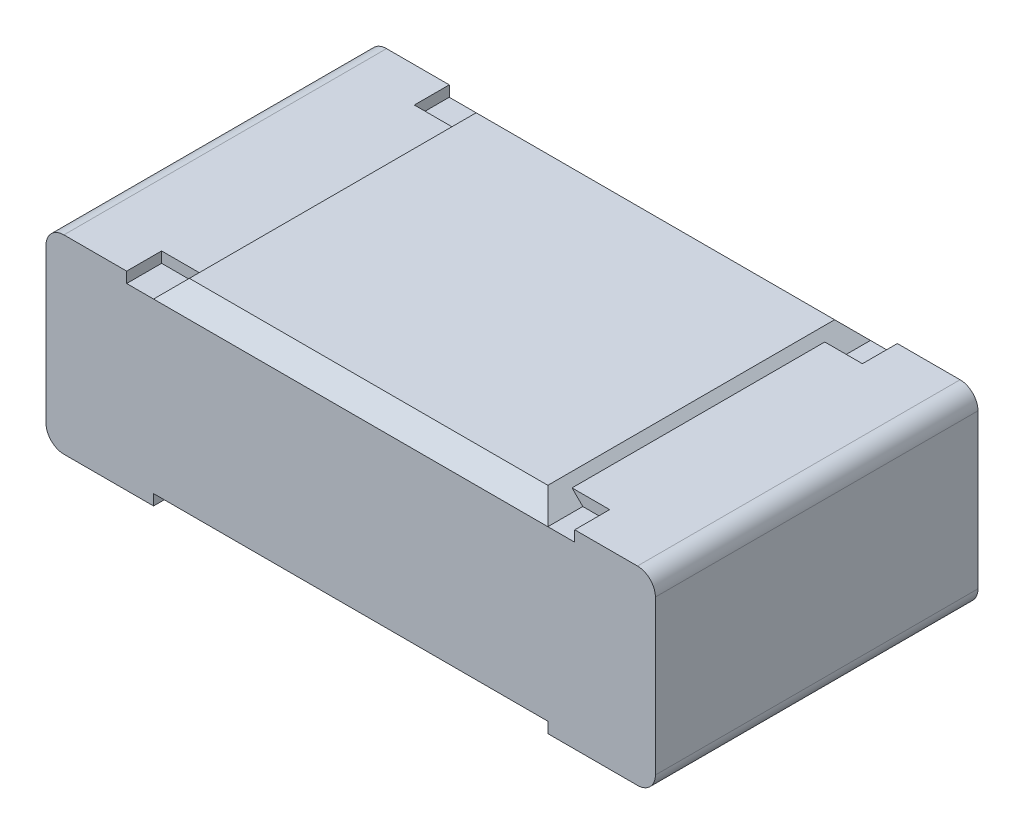
ISO-10303-21;
HEADER;
FILE_DESCRIPTION(('STEP AP214'),'2;1');
FILE_NAME('part.step','',(''),(''),'','','');
FILE_SCHEMA(('AUTOMOTIVE_DESIGN { 1 0 10303 214 1 1 1 1 }'));
ENDSEC;
DATA;
#1=APPLICATION_CONTEXT('core data for automotive mechanical design processes');
#2=APPLICATION_PROTOCOL_DEFINITION('international standard','automotive_design',2000,#1);
#3=PRODUCT_CONTEXT('',#1,'mechanical');
#4=PRODUCT('Part','Part','',(#3));
#5=PRODUCT_RELATED_PRODUCT_CATEGORY('part','',(#4));
#6=PRODUCT_DEFINITION_FORMATION('','',#4);
#7=PRODUCT_DEFINITION_CONTEXT('part definition',#1,'design');
#8=PRODUCT_DEFINITION('design','',#6,#7);
#9=PRODUCT_DEFINITION_SHAPE('','',#8);
#10=(LENGTH_UNIT() NAMED_UNIT(*) SI_UNIT(.MILLI.,.METRE.));
#11=(NAMED_UNIT(*) PLANE_ANGLE_UNIT() SI_UNIT($,.RADIAN.));
#12=(NAMED_UNIT(*) SI_UNIT($,.STERADIAN.) SOLID_ANGLE_UNIT());
#13=UNCERTAINTY_MEASURE_WITH_UNIT(LENGTH_MEASURE(1.E-05),#10,'distance_accuracy_value','');
#14=(GEOMETRIC_REPRESENTATION_CONTEXT(3) GLOBAL_UNCERTAINTY_ASSIGNED_CONTEXT((#13)) GLOBAL_UNIT_ASSIGNED_CONTEXT((#10,
#11,#12)) REPRESENTATION_CONTEXT('',''));
#15=CARTESIAN_POINT('',(0.,0.,0.));
#16=DIRECTION('',(0.,0.,1.));
#17=DIRECTION('',(1.,0.,0.));
#18=AXIS2_PLACEMENT_3D('',#15,#16,#17);
#19=CARTESIAN_POINT('',(-2.052710129873,-22.36241512988,5.071662858095));
#20=DIRECTION('',(1.,5.246545949425E-10,0.));
#21=DIRECTION('',(-5.246545949425E-10,1.,0.));
#22=AXIS2_PLACEMENT_3D('',#19,#20,#21);
#23=PLANE('',#22);
#24=DIRECTION('',(-5.246545949425E-10,1.,0.));
#25=VECTOR('',#24,1.);
#26=CARTESIAN_POINT('',(-2.052710129873,-22.36241512988,4.974162858095));
#27=LINE('',#26,#25);
#28=CARTESIAN_POINT('',(-2.052710129873,-22.362415130045,4.974162858095));
#29=VERTEX_POINT('',#28);
#30=CARTESIAN_POINT('',(-2.05271012988358,-22.3324151298794,4.974162858095));
#31=VERTEX_POINT('',#30);
#32=EDGE_CURVE('E396',#29,#31,#27,.T.);
#33=ORIENTED_EDGE('',*,*,#32,.F.);
#34=DIRECTION('',(0.,0.,1.));
#35=VECTOR('',#34,1.);
#36=CARTESIAN_POINT('',(-2.052710129873,-22.36241513021,5.874162858095));
#37=LINE('',#36,#35);
#38=CARTESIAN_POINT('',(-2.052710129873,-22.36241513021,5.071662858095));
#39=VERTEX_POINT('',#38);
#40=EDGE_CURVE('E246',#39,#29,#37,.F.);
#41=ORIENTED_EDGE('',*,*,#40,.F.);
#42=DIRECTION('',(0.,1.,0.));
#43=VECTOR('',#42,1.);
#44=CARTESIAN_POINT('',(-2.052710129873,-22.36241513053,5.071662858095));
#45=LINE('',#44,#43);
#46=CARTESIAN_POINT('',(-2.05271012988367,-22.3324151298788,5.071662858095));
#47=VERTEX_POINT('',#46);
#48=EDGE_CURVE('E380',#39,#47,#45,.T.);
#49=ORIENTED_EDGE('',*,*,#48,.T.);
#50=DIRECTION('',(0.,0.,1.));
#51=VECTOR('',#50,1.);
#52=CARTESIAN_POINT('',(-2.052710129889,-22.3324151298782,5.874162858095));
#53=LINE('',#52,#51);
#54=EDGE_CURVE('E341',#31,#47,#53,.T.);
#55=ORIENTED_EDGE('',*,*,#54,.F.);
#56=EDGE_LOOP('',(#33,#41,#49,#55));
#57=FACE_BOUND('',#56,.T.);
#58=ADVANCED_FACE('F17',(#57),#23,.F.);
#59=CARTESIAN_POINT('',(-3.302710129873,-22.36241513053,5.071662858095));
#60=DIRECTION('',(0.,0.,1.));
#61=DIRECTION('',(1.,0.,0.));
#62=AXIS2_PLACEMENT_3D('',#59,#60,#61);
#63=PLANE('',#62);
#64=DIRECTION('',(-1.,-5.246533261162E-10,0.));
#65=VECTOR('',#64,1.);
#66=CARTESIAN_POINT('',(-2.227710129889,-22.33241512997,5.071662858095));
#67=LINE('',#66,#65);
#68=CARTESIAN_POINT('',(-2.15771012988567,-22.3324151299338,5.071662858095));
#69=VERTEX_POINT('',#68);
#70=EDGE_CURVE('E337',#47,#69,#67,.T.);
#71=ORIENTED_EDGE('',*,*,#70,.F.);
#72=ORIENTED_EDGE('',*,*,#48,.F.);
#73=DIRECTION('',(-1.,0.,0.));
#74=VECTOR('',#73,1.);
#75=CARTESIAN_POINT('',(-3.477710129611,-22.36241513021,5.071662858095));
#76=LINE('',#75,#74);
#77=CARTESIAN_POINT('',(-2.127710129611,-22.36241513021,5.071662858095));
#78=VERTEX_POINT('',#77);
#79=EDGE_CURVE('E225',#78,#39,#76,.F.);
#80=ORIENTED_EDGE('',*,*,#79,.F.);
#81=DIRECTION('',(-0.707106781186548,0.707106781186548,0.));
#82=VECTOR('',#81,1.);
#83=CARTESIAN_POINT('',(-2.127710129611,-22.36241513021,5.071662858095));
#84=LINE('',#83,#82);
#85=EDGE_CURVE('E300',#69,#78,#84,.F.);
#86=ORIENTED_EDGE('',*,*,#85,.F.);
#87=EDGE_LOOP('',(#71,#72,#80,#86));
#88=FACE_BOUND('',#87,.T.);
#89=ADVANCED_FACE('F576',(#88),#63,.F.);
#90=CARTESIAN_POINT('',(-3.302710129873,-22.36241513053,4.974162858095));
#91=DIRECTION('',(-1.,-5.246545949425E-10,0.));
#92=DIRECTION('',(5.246545949425E-10,-1.,0.));
#93=AXIS2_PLACEMENT_3D('',#90,#91,#92);
#94=PLANE('',#93);
#95=DIRECTION('',(0.,1.,0.));
#96=VECTOR('',#95,1.);
#97=CARTESIAN_POINT('',(-3.302710129889,-22.36241513053,5.071662858095));
#98=LINE('',#97,#96);
#99=CARTESIAN_POINT('',(-3.302710129889,-22.3324151305188,5.071662858095));
#100=VERTEX_POINT('',#99);
#101=CARTESIAN_POINT('',(-3.30271012987833,-22.36241513021,5.071662858095));
#102=VERTEX_POINT('',#101);
#103=EDGE_CURVE('E363',#100,#102,#98,.F.);
#104=ORIENTED_EDGE('',*,*,#103,.T.);
#105=DIRECTION('',(0.,0.,1.));
#106=VECTOR('',#105,1.);
#107=CARTESIAN_POINT('',(-3.302710129873,-22.36241513021,5.874162858095));
#108=LINE('',#107,#106);
#109=CARTESIAN_POINT('',(-3.302710129877,-22.36241513045,4.974162858095));
#110=VERTEX_POINT('',#109);
#111=EDGE_CURVE('E376',#110,#102,#108,.T.);
#112=ORIENTED_EDGE('',*,*,#111,.F.);
#113=DIRECTION('',(0.,1.,0.));
#114=VECTOR('',#113,1.);
#115=CARTESIAN_POINT('',(-3.302710129889,-22.86241513021,4.974162858095));
#116=LINE('',#115,#114);
#117=CARTESIAN_POINT('',(-3.302710129889,-22.3324151305994,4.974162858095));
#118=VERTEX_POINT('',#117);
#119=EDGE_CURVE('E236',#118,#110,#116,.F.);
#120=ORIENTED_EDGE('',*,*,#119,.F.);
#121=DIRECTION('',(0.,0.,1.));
#122=VECTOR('',#121,1.);
#123=CARTESIAN_POINT('',(-3.302710129889,-22.3324151305382,5.874162858095));
#124=LINE('',#123,#122);
#125=EDGE_CURVE('E322',#100,#118,#124,.F.);
#126=ORIENTED_EDGE('',*,*,#125,.F.);
#127=EDGE_LOOP('',(#104,#112,#120,#126));
#128=FACE_BOUND('',#127,.T.);
#129=ADVANCED_FACE('F927',(#128),#94,.F.);
#130=CARTESIAN_POINT('',(-3.302710129873,-22.36241513053,5.071662858095));
#131=DIRECTION('',(0.,0.,1.));
#132=DIRECTION('',(1.,0.,0.));
#133=AXIS2_PLACEMENT_3D('',#130,#131,#132);
#134=PLANE('',#133);
#135=DIRECTION('',(-1.,0.,0.));
#136=VECTOR('',#135,1.);
#137=CARTESIAN_POINT('',(-3.477710129611,-22.36241513021,5.071662858095));
#138=LINE('',#137,#136);
#139=CARTESIAN_POINT('',(-3.227710129611,-22.36241513021,5.071662858095));
#140=VERTEX_POINT('',#139);
#141=EDGE_CURVE('E276',#102,#140,#138,.F.);
#142=ORIENTED_EDGE('',*,*,#141,.F.);
#143=ORIENTED_EDGE('',*,*,#103,.F.);
#144=DIRECTION('',(-1.,-5.246536433228E-10,0.));
#145=VECTOR('',#144,1.);
#146=CARTESIAN_POINT('',(-3.477710129889,-22.33241513063,5.071662858095));
#147=LINE('',#146,#145);
#148=CARTESIAN_POINT('',(-3.197710129882,-22.3324151304817,5.071662858095));
#149=VERTEX_POINT('',#148);
#150=EDGE_CURVE('E326',#149,#100,#147,.T.);
#151=ORIENTED_EDGE('',*,*,#150,.F.);
#152=DIRECTION('',(-0.707106781186548,-0.707106781186548,0.));
#153=VECTOR('',#152,1.);
#154=CARTESIAN_POINT('',(-3.227710129611,-22.36241513021,5.071662858095));
#155=LINE('',#154,#153);
#156=EDGE_CURVE('E299',#140,#149,#155,.F.);
#157=ORIENTED_EDGE('',*,*,#156,.F.);
#158=EDGE_LOOP('',(#142,#143,#151,#157));
#159=FACE_BOUND('',#158,.T.);
#160=ADVANCED_FACE('F633',(#159),#134,.F.);
#161=CARTESIAN_POINT('',(-2.052710129873,-22.36241512988,5.874162858095));
#162=DIRECTION('',(1.,5.246545949425E-10,0.));
#163=DIRECTION('',(-5.246545949425E-10,1.,0.));
#164=AXIS2_PLACEMENT_3D('',#161,#162,#163);
#165=PLANE('',#164);
#166=DIRECTION('',(0.,1.,0.));
#167=VECTOR('',#166,1.);
#168=CARTESIAN_POINT('',(-2.052710129889,-22.36241512988,5.776662858095));
#169=LINE('',#168,#167);
#170=CARTESIAN_POINT('',(-2.052710129889,-22.3324151298955,5.776662858095));
#171=VERTEX_POINT('',#170);
#172=CARTESIAN_POINT('',(-2.05271012987833,-22.36241513021,5.776662858095));
#173=VERTEX_POINT('',#172);
#174=EDGE_CURVE('E357',#171,#173,#169,.F.);
#175=ORIENTED_EDGE('',*,*,#174,.T.);
#176=DIRECTION('',(0.,0.,1.));
#177=VECTOR('',#176,1.);
#178=CARTESIAN_POINT('',(-2.052710129873,-22.36241513021,5.874162858095));
#179=LINE('',#178,#177);
#180=CARTESIAN_POINT('',(-2.052710129873,-22.362415130045,5.874162858095));
#181=VERTEX_POINT('',#180);
#182=EDGE_CURVE('E334',#181,#173,#179,.F.);
#183=ORIENTED_EDGE('',*,*,#182,.F.);
#184=DIRECTION('',(-5.246545949425E-10,1.,0.));
#185=VECTOR('',#184,1.);
#186=CARTESIAN_POINT('',(-2.052710129873,-22.36241512988,5.874162858095));
#187=LINE('',#186,#185);
#188=CARTESIAN_POINT('',(-2.05271012988358,-22.3324151298794,5.874162858095));
#189=VERTEX_POINT('',#188);
#190=EDGE_CURVE('E359',#189,#181,#187,.F.);
#191=ORIENTED_EDGE('',*,*,#190,.F.);
#192=DIRECTION('',(0.,0.,1.));
#193=VECTOR('',#192,1.);
#194=CARTESIAN_POINT('',(-2.052710129889,-22.3324151298782,5.874162858095));
#195=LINE('',#194,#193);
#196=EDGE_CURVE('E338',#171,#189,#195,.T.);
#197=ORIENTED_EDGE('',*,*,#196,.F.);
#198=EDGE_LOOP('',(#175,#183,#191,#197));
#199=FACE_BOUND('',#198,.T.);
#200=ADVANCED_FACE('F598',(#199),#165,.F.);
#201=CARTESIAN_POINT('',(-2.052710129873,-22.36241512988,5.776662858095));
#202=DIRECTION('',(0.,0.,-1.));
#203=DIRECTION('',(-1.,0.,0.));
#204=AXIS2_PLACEMENT_3D('',#201,#202,#203);
#205=PLANE('',#204);
#206=DIRECTION('',(-1.,0.,0.));
#207=VECTOR('',#206,1.);
#208=CARTESIAN_POINT('',(-3.477710129611,-22.36241513021,5.776662858095));
#209=LINE('',#208,#207);
#210=CARTESIAN_POINT('',(-2.127710129611,-22.36241513021,5.776662858095));
#211=VERTEX_POINT('',#210);
#212=EDGE_CURVE('E351',#173,#211,#209,.T.);
#213=ORIENTED_EDGE('',*,*,#212,.F.);
#214=ORIENTED_EDGE('',*,*,#174,.F.);
#215=DIRECTION('',(-1.,-5.246533261162E-10,0.));
#216=VECTOR('',#215,1.);
#217=CARTESIAN_POINT('',(-2.227710129889,-22.33241512997,5.776662858095));
#218=LINE('',#217,#216);
#219=CARTESIAN_POINT('',(-2.157710129887,-22.3324151299338,5.776662858095));
#220=VERTEX_POINT('',#219);
#221=EDGE_CURVE('E342',#220,#171,#218,.F.);
#222=ORIENTED_EDGE('',*,*,#221,.F.);
#223=DIRECTION('',(-0.707106781186548,0.707106781186548,0.));
#224=VECTOR('',#223,1.);
#225=CARTESIAN_POINT('',(-2.127710129611,-22.36241513021,5.776662858095));
#226=LINE('',#225,#224);
#227=EDGE_CURVE('E345',#211,#220,#226,.T.);
#228=ORIENTED_EDGE('',*,*,#227,.F.);
#229=EDGE_LOOP('',(#213,#214,#222,#228));
#230=FACE_BOUND('',#229,.T.);
#231=ADVANCED_FACE('F566',(#230),#205,.F.);
#232=CARTESIAN_POINT('',(-2.227710129889,-22.33241512997,5.874162858095));
#233=DIRECTION('',(-5.246533261162E-10,1.,0.));
#234=DIRECTION('',(-1.,-5.246533261162E-10,0.));
#235=AXIS2_PLACEMENT_3D('',#232,#233,#234);
#236=PLANE('',#235);
#237=ORIENTED_EDGE('',*,*,#54,.T.);
#238=ORIENTED_EDGE('',*,*,#70,.T.);
#239=DIRECTION('',(0.,0.,1.));
#240=VECTOR('',#239,1.);
#241=CARTESIAN_POINT('',(-2.157710129887,-22.332415129934,5.874162858095));
#242=LINE('',#241,#240);
#243=EDGE_CURVE('E348',#220,#69,#242,.F.);
#244=ORIENTED_EDGE('',*,*,#243,.F.);
#245=ORIENTED_EDGE('',*,*,#221,.T.);
#246=ORIENTED_EDGE('',*,*,#196,.T.);
#247=DIRECTION('',(-1.,0.,0.));
#248=VECTOR('',#247,1.);
#249=CARTESIAN_POINT('',(-2.677710129611,-22.33241512988,5.874162858095));
#250=LINE('',#249,#248);
#251=CARTESIAN_POINT('',(-1.8777101298755,-22.332415129835,5.874162858095));
#252=VERTEX_POINT('',#251);
#253=EDGE_CURVE('E448',#189,#252,#250,.F.);
#254=ORIENTED_EDGE('',*,*,#253,.T.);
#255=DIRECTION('',(0.,0.,-1.));
#256=VECTOR('',#255,1.);
#257=CARTESIAN_POINT('',(-1.877710129889,-22.33241512979,5.874162858095));
#258=LINE('',#257,#256);
#259=CARTESIAN_POINT('',(-1.8777101298755,-22.332415129835,4.974162858095));
#260=VERTEX_POINT('',#259);
#261=EDGE_CURVE('E198',#260,#252,#258,.F.);
#262=ORIENTED_EDGE('',*,*,#261,.F.);
#263=DIRECTION('',(-1.,0.,0.));
#264=VECTOR('',#263,1.);
#265=CARTESIAN_POINT('',(-2.677710129611,-22.33241512988,4.974162858095));
#266=LINE('',#265,#264);
#267=EDGE_CURVE('E224',#31,#260,#266,.F.);
#268=ORIENTED_EDGE('',*,*,#267,.F.);
#269=EDGE_LOOP('',(#237,#238,#244,#245,#246,#254,#262,#268));
#270=FACE_BOUND('',#269,.T.);
#271=ADVANCED_FACE('F571',(#270),#236,.T.);
#272=CARTESIAN_POINT('',(-1.877710129862,-22.38241512979,5.874162858095));
#273=DIRECTION('',(0.,0.,-1.));
#274=DIRECTION('',(-1.,0.,0.));
#275=AXIS2_PLACEMENT_3D('',#272,#273,#274);
#276=CYLINDRICAL_SURFACE('',#275,0.05);
#277=CARTESIAN_POINT('',(-1.877710129862,-22.38241512979,4.974162858095));
#278=DIRECTION('',(0.,0.,-1.));
#279=DIRECTION('',(-1.,0.,0.));
#280=AXIS2_PLACEMENT_3D('',#277,#278,#279);
#281=CIRCLE('',#280,0.05);
#282=CARTESIAN_POINT('',(-1.827710129862,-22.382415129775,4.974162858095));
#283=VERTEX_POINT('',#282);
#284=EDGE_CURVE('E20',#260,#283,#281,.T.);
#285=ORIENTED_EDGE('',*,*,#284,.F.);
#286=ORIENTED_EDGE('',*,*,#261,.T.);
#287=CARTESIAN_POINT('',(-1.877710129862,-22.38241512979,5.874162858095));
#288=DIRECTION('',(0.,0.,-1.));
#289=DIRECTION('',(-1.,0.,0.));
#290=AXIS2_PLACEMENT_3D('',#287,#288,#289);
#291=CIRCLE('',#290,0.05);
#292=CARTESIAN_POINT('',(-1.827710129862,-22.382415129775,5.874162858095));
#293=VERTEX_POINT('',#292);
#294=EDGE_CURVE('E209',#252,#293,#291,.T.);
#295=ORIENTED_EDGE('',*,*,#294,.T.);
#296=DIRECTION('',(0.,0.,1.));
#297=VECTOR('',#296,1.);
#298=CARTESIAN_POINT('',(-1.827710129862,-22.38241512976,5.874162858095));
#299=LINE('',#298,#297);
#300=EDGE_CURVE('E203',#283,#293,#299,.T.);
#301=ORIENTED_EDGE('',*,*,#300,.F.);
#302=EDGE_LOOP('',(#285,#286,#295,#301));
#303=FACE_BOUND('',#302,.T.);
#304=ADVANCED_FACE('F205',(#303),#276,.T.);
#305=CARTESIAN_POINT('',(-1.827710129862,-22.38241512976,5.874162858095));
#306=DIRECTION('',(1.,5.246543367511E-10,0.));
#307=DIRECTION('',(-5.246543367511E-10,1.,0.));
#308=AXIS2_PLACEMENT_3D('',#305,#306,#307);
#309=PLANE('',#308);
#310=DIRECTION('',(0.,1.,0.));
#311=VECTOR('',#310,1.);
#312=CARTESIAN_POINT('',(-1.827710129862,-22.86241513021,4.974162858095));
#313=LINE('',#312,#311);
#314=CARTESIAN_POINT('',(-1.8277101297495,-22.812415129775,4.974162858095));
#315=VERTEX_POINT('',#314);
#316=EDGE_CURVE('E215',#283,#315,#313,.F.);
#317=ORIENTED_EDGE('',*,*,#316,.F.);
#318=ORIENTED_EDGE('',*,*,#300,.T.);
#319=DIRECTION('',(0.,1.,0.));
#320=VECTOR('',#319,1.);
#321=CARTESIAN_POINT('',(-1.827710129862,-22.86241513021,5.874162858095));
#322=LINE('',#321,#320);
#323=CARTESIAN_POINT('',(-1.8277101297495,-22.812415129775,5.874162858095));
#324=VERTEX_POINT('',#323);
#325=EDGE_CURVE('E446',#293,#324,#322,.F.);
#326=ORIENTED_EDGE('',*,*,#325,.T.);
#327=DIRECTION('',(0.,0.,-1.));
#328=VECTOR('',#327,1.);
#329=CARTESIAN_POINT('',(-1.827710129637,-22.81241512976,5.874162858095));
#330=LINE('',#329,#328);
#331=EDGE_CURVE('E212',#315,#324,#330,.F.);
#332=ORIENTED_EDGE('',*,*,#331,.F.);
#333=EDGE_LOOP('',(#317,#318,#326,#332));
#334=FACE_BOUND('',#333,.T.);
#335=ADVANCED_FACE('F216',(#334),#309,.T.);
#336=CARTESIAN_POINT('',(-1.877710129637,-22.81241512979,5.874162858095));
#337=DIRECTION('',(0.,0.,-1.));
#338=DIRECTION('',(-1.,0.,0.));
#339=AXIS2_PLACEMENT_3D('',#336,#337,#338);
#340=CYLINDRICAL_SURFACE('',#339,0.05);
#341=CARTESIAN_POINT('',(-1.877710129637,-22.81241512979,4.974162858095));
#342=DIRECTION('',(0.,0.,-1.));
#343=DIRECTION('',(-1.,0.,0.));
#344=AXIS2_PLACEMENT_3D('',#341,#342,#343);
#345=CIRCLE('',#344,0.05);
#346=CARTESIAN_POINT('',(-1.87771012961088,-22.86241512979,4.974162858095));
#347=VERTEX_POINT('',#346);
#348=EDGE_CURVE('E220',#315,#347,#345,.T.);
#349=ORIENTED_EDGE('',*,*,#348,.F.);
#350=ORIENTED_EDGE('',*,*,#331,.T.);
#351=CARTESIAN_POINT('',(-1.877710129637,-22.81241512979,5.874162858095));
#352=DIRECTION('',(0.,0.,-1.));
#353=DIRECTION('',(-1.,0.,0.));
#354=AXIS2_PLACEMENT_3D('',#351,#352,#353);
#355=CIRCLE('',#354,0.05);
#356=CARTESIAN_POINT('',(-1.877710129624,-22.86241512979,5.874162858095));
#357=VERTEX_POINT('',#356);
#358=EDGE_CURVE('E443',#324,#357,#355,.T.);
#359=ORIENTED_EDGE('',*,*,#358,.T.);
#360=DIRECTION('',(0.,0.,1.));
#361=VECTOR('',#360,1.);
#362=CARTESIAN_POINT('',(-1.877710129611,-22.86241512979,5.874162858095));
#363=LINE('',#362,#361);
#364=EDGE_CURVE('E331',#347,#357,#363,.T.);
#365=ORIENTED_EDGE('',*,*,#364,.F.);
#366=EDGE_LOOP('',(#349,#350,#359,#365));
#367=FACE_BOUND('',#366,.T.);
#368=ADVANCED_FACE('F461',(#367),#340,.T.);
#369=CARTESIAN_POINT('',(-3.477710129637,-22.81241513063,5.874162858095));
#370=DIRECTION('',(0.,0.,-1.));
#371=DIRECTION('',(-1.,0.,0.));
#372=AXIS2_PLACEMENT_3D('',#369,#370,#371);
#373=CYLINDRICAL_SURFACE('',#372,0.05);
#374=CARTESIAN_POINT('',(-3.477710129637,-22.81241513063,4.974162858095));
#375=DIRECTION('',(0.,0.,-1.));
#376=DIRECTION('',(-1.,0.,0.));
#377=AXIS2_PLACEMENT_3D('',#374,#375,#376);
#378=CIRCLE('',#377,0.05);
#379=CARTESIAN_POINT('',(-3.477710129624,-22.8624151305556,4.974162858095));
#380=VERTEX_POINT('',#379);
#381=CARTESIAN_POINT('',(-3.527710129637,-22.81241513064,4.974162858095));
#382=VERTEX_POINT('',#381);
#383=EDGE_CURVE('E454',#380,#382,#378,.T.);
#384=ORIENTED_EDGE('',*,*,#383,.F.);
#385=DIRECTION('',(0.,0.,1.));
#386=VECTOR('',#385,1.);
#387=CARTESIAN_POINT('',(-3.477710129611,-22.8624151306212,5.874162858095));
#388=LINE('',#387,#386);
#389=CARTESIAN_POINT('',(-3.477710129624,-22.8624151305556,5.874162858095));
#390=VERTEX_POINT('',#389);
#391=EDGE_CURVE('E269',#390,#380,#388,.F.);
#392=ORIENTED_EDGE('',*,*,#391,.F.);
#393=CARTESIAN_POINT('',(-3.477710129637,-22.81241513063,5.874162858095));
#394=DIRECTION('',(0.,0.,-1.));
#395=DIRECTION('',(-1.,0.,0.));
#396=AXIS2_PLACEMENT_3D('',#393,#394,#395);
#397=CIRCLE('',#396,0.05);
#398=CARTESIAN_POINT('',(-3.527710129637,-22.81241513064,5.874162858095));
#399=VERTEX_POINT('',#398);
#400=EDGE_CURVE('E440',#390,#399,#397,.T.);
#401=ORIENTED_EDGE('',*,*,#400,.T.);
#402=DIRECTION('',(0.,0.,1.));
#403=VECTOR('',#402,1.);
#404=CARTESIAN_POINT('',(-3.527710129637,-22.81241513065,5.874162858095));
#405=LINE('',#404,#403);
#406=EDGE_CURVE('E327',#382,#399,#405,.T.);
#407=ORIENTED_EDGE('',*,*,#406,.F.);
#408=EDGE_LOOP('',(#384,#392,#401,#407));
#409=FACE_BOUND('',#408,.T.);
#410=ADVANCED_FACE('F611',(#409),#373,.T.);
#411=CARTESIAN_POINT('',(-3.527710129637,-22.81241513065,5.874162858095));
#412=DIRECTION('',(-1.,-5.246545949425E-10,0.));
#413=DIRECTION('',(5.246545949425E-10,-1.,0.));
#414=AXIS2_PLACEMENT_3D('',#411,#412,#413);
#415=PLANE('',#414);
#416=DIRECTION('',(0.,1.,0.));
#417=VECTOR('',#416,1.);
#418=CARTESIAN_POINT('',(-3.527710129637,-22.86241513021,4.974162858095));
#419=LINE('',#418,#417);
#420=CARTESIAN_POINT('',(-3.5277101297495,-22.38241513063,4.974162858095));
#421=VERTEX_POINT('',#420);
#422=EDGE_CURVE('E453',#382,#421,#419,.T.);
#423=ORIENTED_EDGE('',*,*,#422,.F.);
#424=ORIENTED_EDGE('',*,*,#406,.T.);
#425=DIRECTION('',(0.,1.,0.));
#426=VECTOR('',#425,1.);
#427=CARTESIAN_POINT('',(-3.527710129637,-22.86241513021,5.874162858095));
#428=LINE('',#427,#426);
#429=CARTESIAN_POINT('',(-3.5277101297495,-22.38241513063,5.874162858095));
#430=VERTEX_POINT('',#429);
#431=EDGE_CURVE('E439',#399,#430,#428,.T.);
#432=ORIENTED_EDGE('',*,*,#431,.T.);
#433=DIRECTION('',(0.,0.,-1.));
#434=VECTOR('',#433,1.);
#435=CARTESIAN_POINT('',(-3.527710129862,-22.38241513063,5.874162858095));
#436=LINE('',#435,#434);
#437=EDGE_CURVE('E323',#421,#430,#436,.F.);
#438=ORIENTED_EDGE('',*,*,#437,.F.);
#439=EDGE_LOOP('',(#423,#424,#432,#438));
#440=FACE_BOUND('',#439,.T.);
#441=ADVANCED_FACE('F615',(#440),#415,.T.);
#442=CARTESIAN_POINT('',(-3.477710129862,-22.38241513063,5.874162858095));
#443=DIRECTION('',(0.,0.,-1.));
#444=DIRECTION('',(-1.,0.,0.));
#445=AXIS2_PLACEMENT_3D('',#442,#443,#444);
#446=CYLINDRICAL_SURFACE('',#445,0.05);
#447=CARTESIAN_POINT('',(-3.477710129862,-22.38241513063,4.974162858095));
#448=DIRECTION('',(0.,0.,-1.));
#449=DIRECTION('',(-1.,0.,0.));
#450=AXIS2_PLACEMENT_3D('',#447,#448,#449);
#451=CIRCLE('',#450,0.05);
#452=CARTESIAN_POINT('',(-3.4777101298755,-22.33241513063,4.974162858095));
#453=VERTEX_POINT('',#452);
#454=EDGE_CURVE('E449',#421,#453,#451,.T.);
#455=ORIENTED_EDGE('',*,*,#454,.F.);
#456=ORIENTED_EDGE('',*,*,#437,.T.);
#457=CARTESIAN_POINT('',(-3.477710129862,-22.38241513063,5.874162858095));
#458=DIRECTION('',(0.,0.,-1.));
#459=DIRECTION('',(-1.,0.,0.));
#460=AXIS2_PLACEMENT_3D('',#457,#458,#459);
#461=CIRCLE('',#460,0.05);
#462=CARTESIAN_POINT('',(-3.4777101298755,-22.33241513063,5.874162858095));
#463=VERTEX_POINT('',#462);
#464=EDGE_CURVE('E436',#430,#463,#461,.T.);
#465=ORIENTED_EDGE('',*,*,#464,.T.);
#466=DIRECTION('',(0.,0.,1.));
#467=VECTOR('',#466,1.);
#468=CARTESIAN_POINT('',(-3.477710129889,-22.33241513063,5.874162858095));
#469=LINE('',#468,#467);
#470=EDGE_CURVE('E317',#453,#463,#469,.T.);
#471=ORIENTED_EDGE('',*,*,#470,.F.);
#472=EDGE_LOOP('',(#455,#456,#465,#471));
#473=FACE_BOUND('',#472,.T.);
#474=ADVANCED_FACE('F619',(#473),#446,.T.);
#475=CARTESIAN_POINT('',(-3.477710129889,-22.33241513063,5.874162858095));
#476=DIRECTION('',(-5.246536433228E-10,1.,0.));
#477=DIRECTION('',(-1.,-5.246536433228E-10,0.));
#478=AXIS2_PLACEMENT_3D('',#475,#476,#477);
#479=PLANE('',#478);
#480=DIRECTION('',(0.,0.,1.));
#481=VECTOR('',#480,1.);
#482=CARTESIAN_POINT('',(-3.30271012988874,-22.33241513053,5.776662858095));
#483=LINE('',#482,#481);
#484=CARTESIAN_POINT('',(-3.30271012988891,-22.3324151305967,5.874162858095));
#485=VERTEX_POINT('',#484);
#486=CARTESIAN_POINT('',(-3.30271012988177,-22.33241513053,5.776662858095));
#487=VERTEX_POINT('',#486);
#488=EDGE_CURVE('E307',#485,#487,#483,.F.);
#489=ORIENTED_EDGE('',*,*,#488,.T.);
#490=DIRECTION('',(-1.,0.,0.));
#491=VECTOR('',#490,1.);
#492=CARTESIAN_POINT('',(-2.052710129873,-22.33241513053,5.776662858095));
#493=LINE('',#492,#491);
#494=CARTESIAN_POINT('',(-3.19771012989525,-22.3324151304943,5.776662858095));
#495=VERTEX_POINT('',#494);
#496=EDGE_CURVE('E306',#487,#495,#493,.F.);
#497=ORIENTED_EDGE('',*,*,#496,.T.);
#498=DIRECTION('',(0.,0.,1.));
#499=VECTOR('',#498,1.);
#500=CARTESIAN_POINT('',(-3.197710129882,-22.332415130481,4.974162858095));
#501=LINE('',#500,#499);
#502=EDGE_CURVE('E289',#149,#495,#501,.T.);
#503=ORIENTED_EDGE('',*,*,#502,.F.);
#504=ORIENTED_EDGE('',*,*,#150,.T.);
#505=ORIENTED_EDGE('',*,*,#125,.T.);
#506=DIRECTION('',(-1.,0.,0.));
#507=VECTOR('',#506,1.);
#508=CARTESIAN_POINT('',(-2.677710129611,-22.33241513063,4.974162858095));
#509=LINE('',#508,#507);
#510=EDGE_CURVE('E452',#453,#118,#509,.F.);
#511=ORIENTED_EDGE('',*,*,#510,.F.);
#512=ORIENTED_EDGE('',*,*,#470,.T.);
#513=DIRECTION('',(-1.,0.,0.));
#514=VECTOR('',#513,1.);
#515=CARTESIAN_POINT('',(-2.677710129611,-22.33241513063,5.874162858095));
#516=LINE('',#515,#514);
#517=EDGE_CURVE('E438',#463,#485,#516,.F.);
#518=ORIENTED_EDGE('',*,*,#517,.T.);
#519=EDGE_LOOP('',(#489,#497,#503,#504,#505,#511,#512,#518));
#520=FACE_BOUND('',#519,.T.);
#521=ADVANCED_FACE('F623',(#520),#479,.T.);
#522=CARTESIAN_POINT('',(-3.302710129873,-22.36241513053,5.776662858095));
#523=DIRECTION('',(-1.,-5.246545949425E-10,0.));
#524=DIRECTION('',(5.246545949425E-10,-1.,0.));
#525=AXIS2_PLACEMENT_3D('',#522,#523,#524);
#526=PLANE('',#525);
#527=DIRECTION('',(0.,1.,0.));
#528=VECTOR('',#527,1.);
#529=CARTESIAN_POINT('',(-3.302710129889,-22.86241513021,5.874162858095));
#530=LINE('',#529,#528);
#531=CARTESIAN_POINT('',(-3.302710129877,-22.36241513045,5.874162858095));
#532=VERTEX_POINT('',#531);
#533=EDGE_CURVE('E646',#485,#532,#530,.F.);
#534=ORIENTED_EDGE('',*,*,#533,.T.);
#535=DIRECTION('',(0.,0.,1.));
#536=VECTOR('',#535,1.);
#537=CARTESIAN_POINT('',(-3.302710129873,-22.36241513021,5.874162858095));
#538=LINE('',#537,#536);
#539=CARTESIAN_POINT('',(-3.302710129873,-22.36241513021,5.776662858095));
#540=VERTEX_POINT('',#539);
#541=EDGE_CURVE('E644',#540,#532,#538,.T.);
#542=ORIENTED_EDGE('',*,*,#541,.F.);
#543=DIRECTION('',(0.,1.,0.));
#544=VECTOR('',#543,1.);
#545=CARTESIAN_POINT('',(-3.302710129873,-22.36241512988,5.776662858095));
#546=LINE('',#545,#544);
#547=EDGE_CURVE('E303',#540,#487,#546,.T.);
#548=ORIENTED_EDGE('',*,*,#547,.T.);
#549=ORIENTED_EDGE('',*,*,#488,.F.);
#550=EDGE_LOOP('',(#534,#542,#548,#549));
#551=FACE_BOUND('',#550,.T.);
#552=ADVANCED_FACE('F661',(#551),#526,.F.);
#553=CARTESIAN_POINT('',(-2.052710129873,-22.36241512988,5.776662858095));
#554=DIRECTION('',(0.,0.,-1.));
#555=DIRECTION('',(-1.,0.,0.));
#556=AXIS2_PLACEMENT_3D('',#553,#554,#555);
#557=PLANE('',#556);
#558=ORIENTED_EDGE('',*,*,#496,.F.);
#559=ORIENTED_EDGE('',*,*,#547,.F.);
#560=DIRECTION('',(-1.,0.,0.));
#561=VECTOR('',#560,1.);
#562=CARTESIAN_POINT('',(-3.477710129611,-22.36241513021,5.776662858095));
#563=LINE('',#562,#561);
#564=CARTESIAN_POINT('',(-3.227710129611,-22.36241513021,5.776662858095));
#565=VERTEX_POINT('',#564);
#566=EDGE_CURVE('E310',#565,#540,#563,.T.);
#567=ORIENTED_EDGE('',*,*,#566,.F.);
#568=DIRECTION('',(-0.707106781186548,-0.707106781186548,0.));
#569=VECTOR('',#568,1.);
#570=CARTESIAN_POINT('',(-3.227710129611,-22.36241513021,5.776662858095));
#571=LINE('',#570,#569);
#572=EDGE_CURVE('E285',#495,#565,#571,.T.);
#573=ORIENTED_EDGE('',*,*,#572,.F.);
#574=EDGE_LOOP('',(#558,#559,#567,#573));
#575=FACE_BOUND('',#574,.T.);
#576=ADVANCED_FACE('F640',(#575),#557,.F.);
#577=CARTESIAN_POINT('',(-2.127710129611,-22.36241513021,5.874162858095));
#578=DIRECTION('',(0.707106781186548,0.707106781186548,0.));
#579=DIRECTION('',(-0.707106781186548,0.707106781186548,0.));
#580=AXIS2_PLACEMENT_3D('',#577,#578,#579);
#581=PLANE('',#580);
#582=DIRECTION('',(-0.577350269189612,0.577350269189627,-0.577350269189637));
#583=VECTOR('',#582,1.);
#584=CARTESIAN_POINT('',(-2.127710129611,-22.36241513021,5.874162858095));
#585=LINE('',#584,#583);
#586=CARTESIAN_POINT('',(-2.127710129611,-22.36241513021,5.874162858095));
#587=VERTEX_POINT('',#586);
#588=CARTESIAN_POINT('',(-2.177710129611,-22.31241513021,5.824162858095));
#589=VERTEX_POINT('',#588);
#590=EDGE_CURVE('E294',#587,#589,#585,.T.);
#591=ORIENTED_EDGE('',*,*,#590,.F.);
#592=DIRECTION('',(0.,0.,1.));
#593=VECTOR('',#592,1.);
#594=CARTESIAN_POINT('',(-2.127710129611,-22.36241513021,5.874162858095));
#595=LINE('',#594,#593);
#596=EDGE_CURVE('E354',#211,#587,#595,.T.);
#597=ORIENTED_EDGE('',*,*,#596,.F.);
#598=ORIENTED_EDGE('',*,*,#227,.T.);
#599=ORIENTED_EDGE('',*,*,#243,.T.);
#600=ORIENTED_EDGE('',*,*,#85,.T.);
#601=DIRECTION('',(0.,0.,1.));
#602=VECTOR('',#601,1.);
#603=CARTESIAN_POINT('',(-2.127710129611,-22.36241513021,5.874162858095));
#604=LINE('',#603,#602);
#605=CARTESIAN_POINT('',(-2.127710129611,-22.36241513021,4.974162858095));
#606=VERTEX_POINT('',#605);
#607=EDGE_CURVE('E228',#606,#78,#604,.T.);
#608=ORIENTED_EDGE('',*,*,#607,.F.);
#609=DIRECTION('',(0.577350269189616,-0.577350269189631,-0.577350269189631));
#610=VECTOR('',#609,1.);
#611=CARTESIAN_POINT('',(-2.177710129611,-22.31241513021,5.024162858095));
#612=LINE('',#611,#610);
#613=CARTESIAN_POINT('',(-2.177710129611,-22.31241513021,5.024162858095));
#614=VERTEX_POINT('',#613);
#615=EDGE_CURVE('E249',#614,#606,#612,.T.);
#616=ORIENTED_EDGE('',*,*,#615,.F.);
#617=DIRECTION('',(0.,0.,1.));
#618=VECTOR('',#617,1.);
#619=CARTESIAN_POINT('',(-2.177710129611,-22.31241513021,5.424162858095));
#620=LINE('',#619,#618);
#621=EDGE_CURVE('E297',#589,#614,#620,.F.);
#622=ORIENTED_EDGE('',*,*,#621,.F.);
#623=EDGE_LOOP('',(#591,#597,#598,#599,#600,#608,#616,#622));
#624=FACE_BOUND('',#623,.T.);
#625=ADVANCED_FACE('F559',(#624),#581,.T.);
#626=CARTESIAN_POINT('',(-2.677710129611,-22.31241513021,5.424162858095));
#627=DIRECTION('',(0.,1.,0.));
#628=DIRECTION('',(-1.,0.,0.));
#629=AXIS2_PLACEMENT_3D('',#626,#627,#628);
#630=PLANE('',#629);
#631=DIRECTION('',(1.,0.,0.));
#632=VECTOR('',#631,1.);
#633=CARTESIAN_POINT('',(-3.227710129611,-22.31241513021,5.824162858095));
#634=LINE('',#633,#632);
#635=CARTESIAN_POINT('',(-3.177710129611,-22.31241513021,5.824162858095));
#636=VERTEX_POINT('',#635);
#637=EDGE_CURVE('E290',#589,#636,#634,.F.);
#638=ORIENTED_EDGE('',*,*,#637,.F.);
#639=ORIENTED_EDGE('',*,*,#621,.T.);
#640=DIRECTION('',(1.,0.,0.));
#641=VECTOR('',#640,1.);
#642=CARTESIAN_POINT('',(-2.127710129611,-22.31241513021,5.024162858095));
#643=LINE('',#642,#641);
#644=CARTESIAN_POINT('',(-3.177710129611,-22.31241513021,5.024162858095));
#645=VERTEX_POINT('',#644);
#646=EDGE_CURVE('E263',#645,#614,#643,.T.);
#647=ORIENTED_EDGE('',*,*,#646,.F.);
#648=DIRECTION('',(0.,0.,1.));
#649=VECTOR('',#648,1.);
#650=CARTESIAN_POINT('',(-3.177710129611,-22.31241513021,4.974162858095));
#651=LINE('',#650,#649);
#652=EDGE_CURVE('E288',#636,#645,#651,.F.);
#653=ORIENTED_EDGE('',*,*,#652,.F.);
#654=EDGE_LOOP('',(#638,#639,#647,#653));
#655=FACE_BOUND('',#654,.T.);
#656=ADVANCED_FACE('F585',(#655),#630,.T.);
#657=CARTESIAN_POINT('',(-3.227710129611,-22.36241513021,4.974162858095));
#658=DIRECTION('',(-0.707106781186548,0.707106781186548,0.));
#659=DIRECTION('',(-0.707106781186548,-0.707106781186548,0.));
#660=AXIS2_PLACEMENT_3D('',#657,#658,#659);
#661=PLANE('',#660);
#662=DIRECTION('',(0.577350269189612,0.577350269189633,0.577350269189633));
#663=VECTOR('',#662,1.);
#664=CARTESIAN_POINT('',(-3.227710129611,-22.36241513021,4.974162858095));
#665=LINE('',#664,#663);
#666=CARTESIAN_POINT('',(-3.22771012962433,-22.3624151303033,4.97416285808167));
#667=VERTEX_POINT('',#666);
#668=EDGE_CURVE('E266',#667,#645,#665,.T.);
#669=ORIENTED_EDGE('',*,*,#668,.F.);
#670=DIRECTION('',(0.,0.,1.));
#671=VECTOR('',#670,1.);
#672=CARTESIAN_POINT('',(-3.227710129611,-22.36241513021,5.874162858095));
#673=LINE('',#672,#671);
#674=EDGE_CURVE('E272',#140,#667,#673,.F.);
#675=ORIENTED_EDGE('',*,*,#674,.F.);
#676=ORIENTED_EDGE('',*,*,#156,.T.);
#677=ORIENTED_EDGE('',*,*,#502,.T.);
#678=ORIENTED_EDGE('',*,*,#572,.T.);
#679=DIRECTION('',(0.,0.,1.));
#680=VECTOR('',#679,1.);
#681=CARTESIAN_POINT('',(-3.227710129611,-22.36241513021,5.874162858095));
#682=LINE('',#681,#680);
#683=CARTESIAN_POINT('',(-3.227710129611,-22.36241513021,5.874162858095));
#684=VERTEX_POINT('',#683);
#685=EDGE_CURVE('E313',#684,#565,#682,.F.);
#686=ORIENTED_EDGE('',*,*,#685,.F.);
#687=DIRECTION('',(-0.577350269189612,-0.577350269189633,0.577350269189633));
#688=VECTOR('',#687,1.);
#689=CARTESIAN_POINT('',(-3.177710129611,-22.31241513021,5.824162858095));
#690=LINE('',#689,#688);
#691=EDGE_CURVE('E293',#636,#684,#690,.T.);
#692=ORIENTED_EDGE('',*,*,#691,.F.);
#693=ORIENTED_EDGE('',*,*,#652,.T.);
#694=EDGE_LOOP('',(#669,#675,#676,#677,#678,#686,#692,#693));
#695=FACE_BOUND('',#694,.T.);
#696=ADVANCED_FACE('F589',(#695),#661,.T.);
#697=CARTESIAN_POINT('',(-3.227710129611,-22.86241513049,5.874162858095));
#698=DIRECTION('',(5.246537757506E-10,-1.,0.));
#699=DIRECTION('',(1.,5.246537757506E-10,0.));
#700=AXIS2_PLACEMENT_3D('',#697,#698,#699);
#701=PLANE('',#700);
#702=DIRECTION('',(-1.,0.,0.));
#703=VECTOR('',#702,1.);
#704=CARTESIAN_POINT('',(-2.677710129611,-22.86241513049,4.974162858095));
#705=LINE('',#704,#703);
#706=CARTESIAN_POINT('',(-3.22771012961551,-22.86241513049,4.974162858095));
#707=VERTEX_POINT('',#706);
#708=EDGE_CURVE('E456',#707,#380,#705,.T.);
#709=ORIENTED_EDGE('',*,*,#708,.F.);
#710=DIRECTION('',(0.,0.,1.));
#711=VECTOR('',#710,1.);
#712=CARTESIAN_POINT('',(-3.22771012961026,-22.86241513049,5.874162858095));
#713=LINE('',#712,#711);
#714=CARTESIAN_POINT('',(-3.22771012961551,-22.86241513049,5.874162858095));
#715=VERTEX_POINT('',#714);
#716=EDGE_CURVE('E279',#715,#707,#713,.F.);
#717=ORIENTED_EDGE('',*,*,#716,.F.);
#718=DIRECTION('',(-1.,0.,0.));
#719=VECTOR('',#718,1.);
#720=CARTESIAN_POINT('',(-2.677710129611,-22.86241513049,5.874162858095));
#721=LINE('',#720,#719);
#722=EDGE_CURVE('E442',#715,#390,#721,.T.);
#723=ORIENTED_EDGE('',*,*,#722,.T.);
#724=ORIENTED_EDGE('',*,*,#391,.T.);
#725=EDGE_LOOP('',(#709,#717,#723,#724));
#726=FACE_BOUND('',#725,.T.);
#727=ADVANCED_FACE('F607',(#726),#701,.T.);
#728=CARTESIAN_POINT('',(-2.127710129611,-22.36241513021,4.974162858095));
#729=DIRECTION('',(0.,0.707106781186548,-0.707106781186548));
#730=DIRECTION('',(0.,0.707106781186548,0.707106781186548));
#731=AXIS2_PLACEMENT_3D('',#728,#729,#730);
#732=PLANE('',#731);
#733=ORIENTED_EDGE('',*,*,#646,.T.);
#734=ORIENTED_EDGE('',*,*,#615,.T.);
#735=DIRECTION('',(-1.,0.,0.));
#736=VECTOR('',#735,1.);
#737=CARTESIAN_POINT('',(-2.677710129611,-22.36241513021,4.974162858095));
#738=LINE('',#737,#736);
#739=EDGE_CURVE('E243',#667,#606,#738,.F.);
#740=ORIENTED_EDGE('',*,*,#739,.F.);
#741=ORIENTED_EDGE('',*,*,#668,.T.);
#742=EDGE_LOOP('',(#733,#734,#740,#741));
#743=FACE_BOUND('',#742,.T.);
#744=ADVANCED_FACE('F582',(#743),#732,.T.);
#745=CARTESIAN_POINT('',(-3.477710129611,-22.36241513021,5.874162858095));
#746=DIRECTION('',(0.,1.,0.));
#747=DIRECTION('',(-1.,0.,0.));
#748=AXIS2_PLACEMENT_3D('',#745,#746,#747);
#749=PLANE('',#748);
#750=ORIENTED_EDGE('',*,*,#607,.T.);
#751=ORIENTED_EDGE('',*,*,#79,.T.);
#752=ORIENTED_EDGE('',*,*,#40,.T.);
#753=DIRECTION('',(-1.,0.,0.));
#754=VECTOR('',#753,1.);
#755=CARTESIAN_POINT('',(-2.677710129611,-22.36241513021,4.974162858095));
#756=LINE('',#755,#754);
#757=EDGE_CURVE('E239',#606,#29,#756,.F.);
#758=ORIENTED_EDGE('',*,*,#757,.F.);
#759=EDGE_LOOP('',(#750,#751,#752,#758));
#760=FACE_BOUND('',#759,.T.);
#761=ADVANCED_FACE('F579',(#760),#749,.T.);
#762=CARTESIAN_POINT('',(-3.477710129611,-22.36241513021,5.874162858095));
#763=DIRECTION('',(0.,1.,0.));
#764=DIRECTION('',(-1.,0.,0.));
#765=AXIS2_PLACEMENT_3D('',#762,#763,#764);
#766=PLANE('',#765);
#767=ORIENTED_EDGE('',*,*,#674,.T.);
#768=DIRECTION('',(-1.,0.,0.));
#769=VECTOR('',#768,1.);
#770=CARTESIAN_POINT('',(-2.677710129611,-22.36241513053,4.974162858095));
#771=LINE('',#770,#769);
#772=EDGE_CURVE('E242',#110,#667,#771,.F.);
#773=ORIENTED_EDGE('',*,*,#772,.F.);
#774=ORIENTED_EDGE('',*,*,#111,.T.);
#775=ORIENTED_EDGE('',*,*,#141,.T.);
#776=EDGE_LOOP('',(#767,#773,#774,#775));
#777=FACE_BOUND('',#776,.T.);
#778=ADVANCED_FACE('F628',(#777),#766,.T.);
#779=CARTESIAN_POINT('',(-1.877710129611,-22.86241512979,5.874162858095));
#780=DIRECTION('',(5.246537845594E-10,-1.,0.));
#781=DIRECTION('',(1.,5.246537845594E-10,0.));
#782=AXIS2_PLACEMENT_3D('',#779,#780,#781);
#783=PLANE('',#782);
#784=DIRECTION('',(1.,5.246537845594E-10,0.));
#785=VECTOR('',#784,1.);
#786=CARTESIAN_POINT('',(-1.877710129611,-22.86241512979,4.974162858095));
#787=LINE('',#786,#785);
#788=CARTESIAN_POINT('',(-2.127710129611,-22.8624151298771,4.974162858095));
#789=VERTEX_POINT('',#788);
#790=EDGE_CURVE('E275',#789,#347,#787,.T.);
#791=ORIENTED_EDGE('',*,*,#790,.T.);
#792=ORIENTED_EDGE('',*,*,#364,.T.);
#793=DIRECTION('',(-1.,0.,0.));
#794=VECTOR('',#793,1.);
#795=CARTESIAN_POINT('',(-2.677710129611,-22.86241512979,5.874162858095));
#796=LINE('',#795,#794);
#797=CARTESIAN_POINT('',(-2.127710129611,-22.8624151298767,5.874162858095));
#798=VERTEX_POINT('',#797);
#799=EDGE_CURVE('E445',#357,#798,#796,.T.);
#800=ORIENTED_EDGE('',*,*,#799,.T.);
#801=DIRECTION('',(0.,0.,1.));
#802=VECTOR('',#801,1.);
#803=CARTESIAN_POINT('',(-2.127710129611,-22.86241512992,5.874162858095));
#804=LINE('',#803,#802);
#805=EDGE_CURVE('E466',#789,#798,#804,.T.);
#806=ORIENTED_EDGE('',*,*,#805,.F.);
#807=EDGE_LOOP('',(#791,#792,#800,#806));
#808=FACE_BOUND('',#807,.T.);
#809=ADVANCED_FACE('F465',(#808),#783,.T.);
#810=CARTESIAN_POINT('',(-3.477710129611,-22.36241513021,5.874162858095));
#811=DIRECTION('',(0.,1.,0.));
#812=DIRECTION('',(-1.,0.,0.));
#813=AXIS2_PLACEMENT_3D('',#810,#811,#812);
#814=PLANE('',#813);
#815=ORIENTED_EDGE('',*,*,#596,.T.);
#816=DIRECTION('',(-1.,0.,0.));
#817=VECTOR('',#816,1.);
#818=CARTESIAN_POINT('',(-2.677710129611,-22.36241513021,5.874162858095));
#819=LINE('',#818,#817);
#820=EDGE_CURVE('E467',#587,#181,#819,.F.);
#821=ORIENTED_EDGE('',*,*,#820,.T.);
#822=ORIENTED_EDGE('',*,*,#182,.T.);
#823=ORIENTED_EDGE('',*,*,#212,.T.);
#824=EDGE_LOOP('',(#815,#821,#822,#823));
#825=FACE_BOUND('',#824,.T.);
#826=ADVANCED_FACE('F562',(#825),#814,.T.);
#827=CARTESIAN_POINT('',(-3.477710129611,-22.36241513021,5.874162858095));
#828=DIRECTION('',(0.,1.,0.));
#829=DIRECTION('',(-1.,0.,0.));
#830=AXIS2_PLACEMENT_3D('',#827,#828,#829);
#831=PLANE('',#830);
#832=ORIENTED_EDGE('',*,*,#685,.T.);
#833=ORIENTED_EDGE('',*,*,#566,.T.);
#834=ORIENTED_EDGE('',*,*,#541,.T.);
#835=DIRECTION('',(-1.,0.,0.));
#836=VECTOR('',#835,1.);
#837=CARTESIAN_POINT('',(-2.677710129611,-22.36241513053,5.874162858095));
#838=LINE('',#837,#836);
#839=EDGE_CURVE('E470',#532,#684,#838,.F.);
#840=ORIENTED_EDGE('',*,*,#839,.T.);
#841=EDGE_LOOP('',(#832,#833,#834,#840));
#842=FACE_BOUND('',#841,.T.);
#843=ADVANCED_FACE('F643',(#842),#831,.T.);
#844=CARTESIAN_POINT('',(-3.227710129611,-22.36241513021,5.874162858095));
#845=DIRECTION('',(0.,0.707106781186548,0.707106781186548));
#846=DIRECTION('',(0.,-0.707106781186548,0.707106781186548));
#847=AXIS2_PLACEMENT_3D('',#844,#845,#846);
#848=PLANE('',#847);
#849=ORIENTED_EDGE('',*,*,#637,.T.);
#850=ORIENTED_EDGE('',*,*,#691,.T.);
#851=DIRECTION('',(-1.,0.,0.));
#852=VECTOR('',#851,1.);
#853=CARTESIAN_POINT('',(-2.677710129611,-22.36241513021,5.874162858095));
#854=LINE('',#853,#852);
#855=EDGE_CURVE('E512',#684,#587,#854,.F.);
#856=ORIENTED_EDGE('',*,*,#855,.T.);
#857=ORIENTED_EDGE('',*,*,#590,.T.);
#858=EDGE_LOOP('',(#849,#850,#856,#857));
#859=FACE_BOUND('',#858,.T.);
#860=ADVANCED_FACE('F553',(#859),#848,.T.);
#861=CARTESIAN_POINT('',(-3.227710129626,-22.83241513049,5.874162858095));
#862=DIRECTION('',(1.,5.246545949425E-10,0.));
#863=DIRECTION('',(-5.246545949425E-10,1.,0.));
#864=AXIS2_PLACEMENT_3D('',#861,#862,#863);
#865=PLANE('',#864);
#866=DIRECTION('',(-5.246545949425E-10,1.,0.));
#867=VECTOR('',#866,1.);
#868=CARTESIAN_POINT('',(-3.227710129626,-22.83241513049,4.974162858095));
#869=LINE('',#868,#867);
#870=CARTESIAN_POINT('',(-3.227710129626,-22.832415130315,4.974162858095));
#871=VERTEX_POINT('',#870);
#872=EDGE_CURVE('E258',#707,#871,#869,.T.);
#873=ORIENTED_EDGE('',*,*,#872,.T.);
#874=DIRECTION('',(0.,0.,1.));
#875=VECTOR('',#874,1.);
#876=CARTESIAN_POINT('',(-3.227710129626,-22.83241513021,5.874162858095));
#877=LINE('',#876,#875);
#878=CARTESIAN_POINT('',(-3.227710129626,-22.83241513035,5.874162858095));
#879=VERTEX_POINT('',#878);
#880=EDGE_CURVE('E506',#879,#871,#877,.F.);
#881=ORIENTED_EDGE('',*,*,#880,.F.);
#882=DIRECTION('',(-5.246545949425E-10,1.,0.));
#883=VECTOR('',#882,1.);
#884=CARTESIAN_POINT('',(-3.227710129626,-22.83241513049,5.874162858095));
#885=LINE('',#884,#883);
#886=EDGE_CURVE('E282',#879,#715,#885,.F.);
#887=ORIENTED_EDGE('',*,*,#886,.T.);
#888=ORIENTED_EDGE('',*,*,#716,.T.);
#889=EDGE_LOOP('',(#873,#881,#887,#888));
#890=FACE_BOUND('',#889,.T.);
#891=ADVANCED_FACE('F604',(#890),#865,.T.);
#892=CARTESIAN_POINT('',(-2.677710129611,-22.86241513021,4.974162858095));
#893=DIRECTION('',(0.,0.,-1.));
#894=DIRECTION('',(-1.,0.,0.));
#895=AXIS2_PLACEMENT_3D('',#892,#893,#894);
#896=PLANE('',#895);
#897=DIRECTION('',(1.,0.,0.));
#898=VECTOR('',#897,1.);
#899=CARTESIAN_POINT('',(-1.877710129611,-22.83241513021,4.974162858095));
#900=LINE('',#899,#898);
#901=CARTESIAN_POINT('',(-2.1277101296223,-22.8324151301133,4.974162858095));
#902=VERTEX_POINT('',#901);
#903=EDGE_CURVE('E504',#871,#902,#900,.T.);
#904=ORIENTED_EDGE('',*,*,#903,.F.);
#905=ORIENTED_EDGE('',*,*,#872,.F.);
#906=ORIENTED_EDGE('',*,*,#708,.T.);
#907=ORIENTED_EDGE('',*,*,#383,.T.);
#908=ORIENTED_EDGE('',*,*,#422,.T.);
#909=ORIENTED_EDGE('',*,*,#454,.T.);
#910=ORIENTED_EDGE('',*,*,#510,.T.);
#911=ORIENTED_EDGE('',*,*,#119,.T.);
#912=ORIENTED_EDGE('',*,*,#772,.T.);
#913=ORIENTED_EDGE('',*,*,#739,.T.);
#914=ORIENTED_EDGE('',*,*,#757,.T.);
#915=ORIENTED_EDGE('',*,*,#32,.T.);
#916=ORIENTED_EDGE('',*,*,#267,.T.);
#917=ORIENTED_EDGE('',*,*,#284,.T.);
#918=ORIENTED_EDGE('',*,*,#316,.T.);
#919=ORIENTED_EDGE('',*,*,#348,.T.);
#920=ORIENTED_EDGE('',*,*,#790,.F.);
#921=DIRECTION('',(0.,1.,0.));
#922=VECTOR('',#921,1.);
#923=CARTESIAN_POINT('',(-2.127710129611,-22.86241513021,4.974162858095));
#924=LINE('',#923,#922);
#925=EDGE_CURVE('E234',#789,#902,#924,.T.);
#926=ORIENTED_EDGE('',*,*,#925,.T.);
#927=EDGE_LOOP('',(#904,#905,#906,#907,#908,#909,#910,#911,#912,#913,#914,#915,#916,#917,#918,
#919,#920,#926));
#928=FACE_BOUND('',#927,.T.);
#929=ADVANCED_FACE('F223',(#928),#896,.T.);
#930=CARTESIAN_POINT('',(-2.127710129611,-22.86241512992,5.874162858095));
#931=DIRECTION('',(-1.,-5.246545949425E-10,0.));
#932=DIRECTION('',(5.246545949425E-10,-1.,0.));
#933=AXIS2_PLACEMENT_3D('',#930,#931,#932);
#934=PLANE('',#933);
#935=ORIENTED_EDGE('',*,*,#925,.F.);
#936=ORIENTED_EDGE('',*,*,#805,.T.);
#937=DIRECTION('',(5.246545949425E-10,-1.,0.));
#938=VECTOR('',#937,1.);
#939=CARTESIAN_POINT('',(-2.127710129611,-22.86241512992,5.874162858095));
#940=LINE('',#939,#938);
#941=CARTESIAN_POINT('',(-2.12771012962628,-22.8324151301012,5.874162858095));
#942=VERTEX_POINT('',#941);
#943=EDGE_CURVE('E35',#798,#942,#940,.F.);
#944=ORIENTED_EDGE('',*,*,#943,.T.);
#945=DIRECTION('',(0.,0.,1.));
#946=VECTOR('',#945,1.);
#947=CARTESIAN_POINT('',(-2.127710129626,-22.83241513021,5.874162858095));
#948=LINE('',#947,#946);
#949=EDGE_CURVE('E26',#902,#942,#948,.T.);
#950=ORIENTED_EDGE('',*,*,#949,.F.);
#951=EDGE_LOOP('',(#935,#936,#944,#950));
#952=FACE_BOUND('',#951,.T.);
#953=ADVANCED_FACE('F600',(#952),#934,.T.);
#954=CARTESIAN_POINT('',(-2.677710129611,-22.86241513021,5.874162858095));
#955=DIRECTION('',(0.,0.,-1.));
#956=DIRECTION('',(-1.,0.,0.));
#957=AXIS2_PLACEMENT_3D('',#954,#955,#956);
#958=PLANE('',#957);
#959=ORIENTED_EDGE('',*,*,#839,.F.);
#960=ORIENTED_EDGE('',*,*,#533,.F.);
#961=ORIENTED_EDGE('',*,*,#517,.F.);
#962=ORIENTED_EDGE('',*,*,#464,.F.);
#963=ORIENTED_EDGE('',*,*,#431,.F.);
#964=ORIENTED_EDGE('',*,*,#400,.F.);
#965=ORIENTED_EDGE('',*,*,#722,.F.);
#966=ORIENTED_EDGE('',*,*,#886,.F.);
#967=DIRECTION('',(1.,0.,0.));
#968=VECTOR('',#967,1.);
#969=CARTESIAN_POINT('',(-1.877710129611,-22.83241513021,5.874162858095));
#970=LINE('',#969,#968);
#971=EDGE_CURVE('E11',#942,#879,#970,.F.);
#972=ORIENTED_EDGE('',*,*,#971,.F.);
#973=ORIENTED_EDGE('',*,*,#943,.F.);
#974=ORIENTED_EDGE('',*,*,#799,.F.);
#975=ORIENTED_EDGE('',*,*,#358,.F.);
#976=ORIENTED_EDGE('',*,*,#325,.F.);
#977=ORIENTED_EDGE('',*,*,#294,.F.);
#978=ORIENTED_EDGE('',*,*,#253,.F.);
#979=ORIENTED_EDGE('',*,*,#190,.T.);
#980=ORIENTED_EDGE('',*,*,#820,.F.);
#981=ORIENTED_EDGE('',*,*,#855,.F.);
#982=EDGE_LOOP('',(#959,#960,#961,#962,#963,#964,#965,#966,#972,#973,#974,#975,#976,#977,#978,
#979,#980,#981));
#983=FACE_BOUND('',#982,.T.);
#984=ADVANCED_FACE('F594',(#983),#958,.F.);
#985=CARTESIAN_POINT('',(-1.877710129611,-22.83241513021,5.874162858095));
#986=DIRECTION('',(0.,-1.,0.));
#987=DIRECTION('',(1.,0.,0.));
#988=AXIS2_PLACEMENT_3D('',#985,#986,#987);
#989=PLANE('',#988);
#990=ORIENTED_EDGE('',*,*,#949,.T.);
#991=ORIENTED_EDGE('',*,*,#971,.T.);
#992=ORIENTED_EDGE('',*,*,#880,.T.);
#993=ORIENTED_EDGE('',*,*,#903,.T.);
#994=EDGE_LOOP('',(#990,#991,#992,#993));
#995=FACE_BOUND('',#994,.T.);
#996=ADVANCED_FACE('F599',(#995),#989,.T.);
#997=CLOSED_SHELL('',(#58,#89,#129,#160,#200,#231,#271,#304,#335,#368,#410,#441,#474,#521,#552,
#576,#625,#656,#696,#727,#744,#761,#778,#809,#826,#843,#860,#891,#929,#953,#984,#996));
#998=MANIFOLD_SOLID_BREP('B1',#997);
#999=ADVANCED_BREP_SHAPE_REPRESENTATION('',(#18,#998),#14);
#1000=SHAPE_DEFINITION_REPRESENTATION(#9,#999);
ENDSEC;
END-ISO-10303-21;
